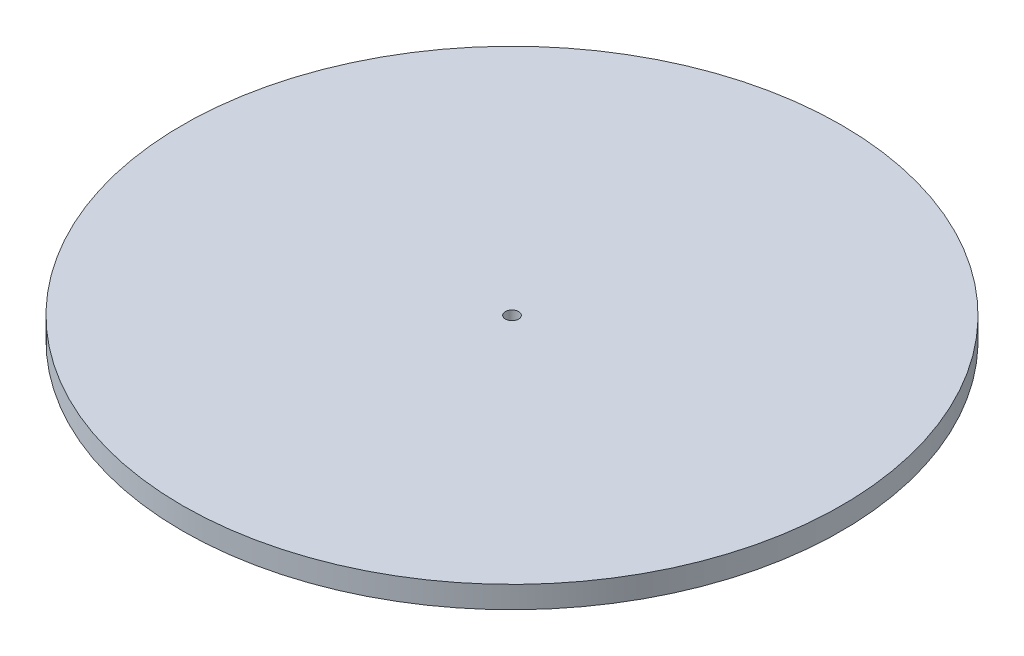
ISO-10303-21;
HEADER;
FILE_DESCRIPTION(('STEP AP214'),'2;1');
FILE_NAME('part.step','',(''),(''),'','','');
FILE_SCHEMA(('AUTOMOTIVE_DESIGN { 1 0 10303 214 1 1 1 1 }'));
ENDSEC;
DATA;
#1=APPLICATION_CONTEXT('core data for automotive mechanical design processes');
#2=APPLICATION_PROTOCOL_DEFINITION('international standard','automotive_design',2000,#1);
#3=PRODUCT_CONTEXT('',#1,'mechanical');
#4=PRODUCT('Part','Part','',(#3));
#5=PRODUCT_RELATED_PRODUCT_CATEGORY('part','',(#4));
#6=PRODUCT_DEFINITION_FORMATION('','',#4);
#7=PRODUCT_DEFINITION_CONTEXT('part definition',#1,'design');
#8=PRODUCT_DEFINITION('design','',#6,#7);
#9=PRODUCT_DEFINITION_SHAPE('','',#8);
#10=(LENGTH_UNIT() NAMED_UNIT(*) SI_UNIT(.MILLI.,.METRE.));
#11=(NAMED_UNIT(*) PLANE_ANGLE_UNIT() SI_UNIT($,.RADIAN.));
#12=(NAMED_UNIT(*) SI_UNIT($,.STERADIAN.) SOLID_ANGLE_UNIT());
#13=UNCERTAINTY_MEASURE_WITH_UNIT(LENGTH_MEASURE(1.E-05),#10,'distance_accuracy_value','');
#14=(GEOMETRIC_REPRESENTATION_CONTEXT(3) GLOBAL_UNCERTAINTY_ASSIGNED_CONTEXT((#13)) GLOBAL_UNIT_ASSIGNED_CONTEXT((#10,
#11,#12)) REPRESENTATION_CONTEXT('',''));
#15=CARTESIAN_POINT('',(0.,0.,0.));
#16=DIRECTION('',(0.,0.,1.));
#17=DIRECTION('',(1.,0.,0.));
#18=AXIS2_PLACEMENT_3D('',#15,#16,#17);
#19=CARTESIAN_POINT('',(0.,10.,0.));
#20=DIRECTION('',(0.,1.,0.));
#21=DIRECTION('',(0.,0.,1.));
#22=AXIS2_PLACEMENT_3D('',#19,#20,#21);
#23=PLANE('',#22);
#24=CARTESIAN_POINT('',(0.,10.,0.));
#25=DIRECTION('',(0.,1.,0.));
#26=DIRECTION('',(0.,0.,1.));
#27=AXIS2_PLACEMENT_3D('',#24,#25,#26);
#28=CIRCLE('',#27,150.);
#29=CARTESIAN_POINT('',(0.,10.,150.));
#30=VERTEX_POINT('',#29);
#31=EDGE_CURVE('E10',#30,#30,#28,.T.);
#32=ORIENTED_EDGE('',*,*,#31,.T.);
#33=EDGE_LOOP('',(#32));
#34=FACE_BOUND('',#33,.T.);
#35=CARTESIAN_POINT('',(0.,10.,0.));
#36=DIRECTION('',(0.,1.,0.));
#37=DIRECTION('',(0.,0.,1.));
#38=AXIS2_PLACEMENT_3D('',#35,#36,#37);
#39=CIRCLE('',#38,3.);
#40=CARTESIAN_POINT('',(0.,10.,3.));
#41=VERTEX_POINT('',#40);
#42=EDGE_CURVE('E50',#41,#41,#39,.T.);
#43=ORIENTED_EDGE('',*,*,#42,.F.);
#44=EDGE_LOOP('',(#43));
#45=FACE_BOUND('',#44,.T.);
#46=ADVANCED_FACE('F37',(#34,#45),#23,.T.);
#47=CARTESIAN_POINT('',(0.,0.,0.));
#48=DIRECTION('',(0.,1.,0.));
#49=DIRECTION('',(0.,0.,1.));
#50=AXIS2_PLACEMENT_3D('',#47,#48,#49);
#51=PLANE('',#50);
#52=CARTESIAN_POINT('',(0.,0.,0.));
#53=DIRECTION('',(0.,1.,0.));
#54=DIRECTION('',(0.,0.,1.));
#55=AXIS2_PLACEMENT_3D('',#52,#53,#54);
#56=CIRCLE('',#55,150.);
#57=CARTESIAN_POINT('',(0.,0.,150.));
#58=VERTEX_POINT('',#57);
#59=EDGE_CURVE('E41',#58,#58,#56,.T.);
#60=ORIENTED_EDGE('',*,*,#59,.F.);
#61=EDGE_LOOP('',(#60));
#62=FACE_BOUND('',#61,.T.);
#63=CARTESIAN_POINT('',(0.,0.,0.));
#64=DIRECTION('',(0.,1.,0.));
#65=DIRECTION('',(0.,0.,1.));
#66=AXIS2_PLACEMENT_3D('',#63,#64,#65);
#67=CIRCLE('',#66,3.);
#68=CARTESIAN_POINT('',(0.,0.,3.));
#69=VERTEX_POINT('',#68);
#70=EDGE_CURVE('E52',#69,#69,#67,.T.);
#71=ORIENTED_EDGE('',*,*,#70,.T.);
#72=EDGE_LOOP('',(#71));
#73=FACE_BOUND('',#72,.T.);
#74=ADVANCED_FACE('F62',(#62,#73),#51,.F.);
#75=CARTESIAN_POINT('',(0.,10.,0.));
#76=DIRECTION('',(0.,-1.,0.));
#77=DIRECTION('',(0.,0.,-1.));
#78=AXIS2_PLACEMENT_3D('',#75,#76,#77);
#79=CYLINDRICAL_SURFACE('',#78,150.);
#80=ORIENTED_EDGE('',*,*,#31,.F.);
#81=EDGE_LOOP('',(#80));
#82=FACE_BOUND('',#81,.T.);
#83=ORIENTED_EDGE('',*,*,#59,.T.);
#84=EDGE_LOOP('',(#83));
#85=FACE_BOUND('',#84,.T.);
#86=ADVANCED_FACE('F39',(#82,#85),#79,.T.);
#87=CARTESIAN_POINT('',(0.,10.,0.));
#88=DIRECTION('',(0.,-1.,0.));
#89=DIRECTION('',(0.,0.,-1.));
#90=AXIS2_PLACEMENT_3D('',#87,#88,#89);
#91=CYLINDRICAL_SURFACE('',#90,3.);
#92=ORIENTED_EDGE('',*,*,#42,.T.);
#93=EDGE_LOOP('',(#92));
#94=FACE_BOUND('',#93,.T.);
#95=ORIENTED_EDGE('',*,*,#70,.F.);
#96=EDGE_LOOP('',(#95));
#97=FACE_BOUND('',#96,.T.);
#98=ADVANCED_FACE('F58',(#94,#97),#91,.F.);
#99=CLOSED_SHELL('',(#46,#74,#86,#98));
#100=MANIFOLD_SOLID_BREP('B2',#99);
#101=ADVANCED_BREP_SHAPE_REPRESENTATION('',(#18,#100),#14);
#102=SHAPE_DEFINITION_REPRESENTATION(#9,#101);
ENDSEC;
END-ISO-10303-21;
